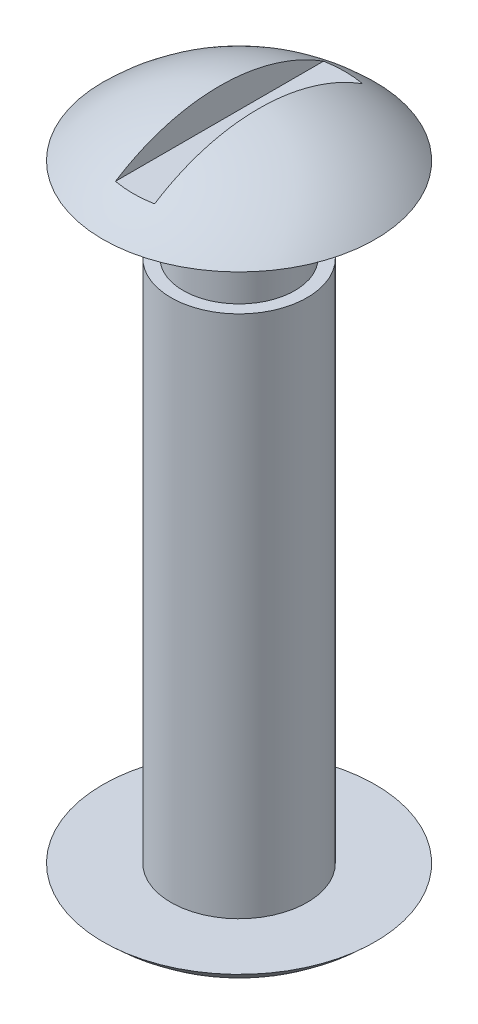
ISO-10303-21;
HEADER;
FILE_DESCRIPTION(('STEP AP214'),'2;1');
FILE_NAME('part.step','',(''),(''),'','','');
FILE_SCHEMA(('AUTOMOTIVE_DESIGN { 1 0 10303 214 1 1 1 1 }'));
ENDSEC;
DATA;
#1=APPLICATION_CONTEXT('core data for automotive mechanical design processes');
#2=APPLICATION_PROTOCOL_DEFINITION('international standard','automotive_design',2000,#1);
#3=PRODUCT_CONTEXT('',#1,'mechanical');
#4=PRODUCT('Part','Part','',(#3));
#5=PRODUCT_RELATED_PRODUCT_CATEGORY('part','',(#4));
#6=PRODUCT_DEFINITION_FORMATION('','',#4);
#7=PRODUCT_DEFINITION_CONTEXT('part definition',#1,'design');
#8=PRODUCT_DEFINITION('design','',#6,#7);
#9=PRODUCT_DEFINITION_SHAPE('','',#8);
#10=(LENGTH_UNIT() NAMED_UNIT(*) SI_UNIT(.MILLI.,.METRE.));
#11=(NAMED_UNIT(*) PLANE_ANGLE_UNIT() SI_UNIT($,.RADIAN.));
#12=(NAMED_UNIT(*) SI_UNIT($,.STERADIAN.) SOLID_ANGLE_UNIT());
#13=UNCERTAINTY_MEASURE_WITH_UNIT(LENGTH_MEASURE(1.E-05),#10,'distance_accuracy_value','');
#14=(GEOMETRIC_REPRESENTATION_CONTEXT(3) GLOBAL_UNCERTAINTY_ASSIGNED_CONTEXT((#13)) GLOBAL_UNIT_ASSIGNED_CONTEXT((#10,
#11,#12)) REPRESENTATION_CONTEXT('',''));
#15=CARTESIAN_POINT('',(0.,0.,0.));
#16=DIRECTION('',(0.,0.,1.));
#17=DIRECTION('',(1.,0.,0.));
#18=AXIS2_PLACEMENT_3D('',#15,#16,#17);
#19=CARTESIAN_POINT('',(2.4765,19.05,0.));
#20=DIRECTION('',(0.,-1.,0.));
#21=DIRECTION('',(1.,0.,0.));
#22=AXIS2_PLACEMENT_3D('',#19,#20,#21);
#23=PLANE('',#22);
#24=CARTESIAN_POINT('',(0.,19.05,0.));
#25=DIRECTION('',(0.,1.,0.));
#26=DIRECTION('',(-1.,0.,0.));
#27=AXIS2_PLACEMENT_3D('',#24,#25,#26);
#28=CIRCLE('',#27,2.032);
#29=CARTESIAN_POINT('',(-2.032,19.05,0.));
#30=VERTEX_POINT('',#29);
#31=EDGE_CURVE('E68',#30,#30,#28,.T.);
#32=ORIENTED_EDGE('',*,*,#31,.F.);
#33=EDGE_LOOP('',(#32));
#34=FACE_BOUND('',#33,.T.);
#35=CARTESIAN_POINT('',(0.,19.05,0.));
#36=DIRECTION('',(0.,1.,0.));
#37=DIRECTION('',(-1.,0.,0.));
#38=AXIS2_PLACEMENT_3D('',#35,#36,#37);
#39=CIRCLE('',#38,2.4765);
#40=CARTESIAN_POINT('',(-2.4765,19.05,0.));
#41=VERTEX_POINT('',#40);
#42=EDGE_CURVE('E72',#41,#41,#39,.T.);
#43=ORIENTED_EDGE('',*,*,#42,.T.);
#44=EDGE_LOOP('',(#43));
#45=FACE_BOUND('',#44,.T.);
#46=ADVANCED_FACE('F33',(#34,#45),#23,.F.);
#47=CARTESIAN_POINT('',(0.,24.1554,0.));
#48=DIRECTION('',(0.,1.,0.));
#49=DIRECTION('',(-1.,0.,0.));
#50=AXIS2_PLACEMENT_3D('',#47,#48,#49);
#51=CYLINDRICAL_SURFACE('',#50,2.4765);
#52=ORIENTED_EDGE('',*,*,#42,.F.);
#53=EDGE_LOOP('',(#52));
#54=FACE_BOUND('',#53,.T.);
#55=CARTESIAN_POINT('',(0.,0.,0.));
#56=DIRECTION('',(0.,1.,0.));
#57=DIRECTION('',(-1.,0.,0.));
#58=AXIS2_PLACEMENT_3D('',#55,#56,#57);
#59=CIRCLE('',#58,2.4765);
#60=CARTESIAN_POINT('',(-2.4765,0.,0.));
#61=VERTEX_POINT('',#60);
#62=EDGE_CURVE('E76',#61,#61,#59,.T.);
#63=ORIENTED_EDGE('',*,*,#62,.T.);
#64=EDGE_LOOP('',(#63));
#65=FACE_BOUND('',#64,.T.);
#66=ADVANCED_FACE('F96',(#54,#65),#51,.T.);
#67=CARTESIAN_POINT('',(2.4765,0.,0.));
#68=DIRECTION('',(0.,-1.,0.));
#69=DIRECTION('',(1.,0.,0.));
#70=AXIS2_PLACEMENT_3D('',#67,#68,#69);
#71=PLANE('',#70);
#72=ORIENTED_EDGE('',*,*,#62,.F.);
#73=EDGE_LOOP('',(#72));
#74=FACE_BOUND('',#73,.T.);
#75=CARTESIAN_POINT('',(0.,0.,0.));
#76=DIRECTION('',(0.,1.,0.));
#77=DIRECTION('',(-1.,0.,0.));
#78=AXIS2_PLACEMENT_3D('',#75,#76,#77);
#79=CIRCLE('',#78,4.95300000000001);
#80=CARTESIAN_POINT('',(-4.95300000000001,0.,0.));
#81=VERTEX_POINT('',#80);
#82=EDGE_CURVE('E79',#81,#81,#79,.T.);
#83=ORIENTED_EDGE('',*,*,#82,.T.);
#84=EDGE_LOOP('',(#83));
#85=FACE_BOUND('',#84,.T.);
#86=ADVANCED_FACE('F101',(#74,#85),#71,.F.);
#87=CARTESIAN_POINT('',(0.,5.02046875000001,0.));
#88=DIRECTION('',(0.,1.,0.));
#89=DIRECTION('',(-1.,0.,0.));
#90=AXIS2_PLACEMENT_3D('',#87,#88,#89);
#91=SPHERICAL_SURFACE('',#90,7.05246875000001);
#92=ORIENTED_EDGE('',*,*,#82,.F.);
#93=EDGE_LOOP('',(#92));
#94=FACE_BOUND('',#93,.T.);
#95=ADVANCED_FACE('F106',(#94),#91,.T.);
#96=CARTESIAN_POINT('',(0.,17.10293125,0.));
#97=DIRECTION('',(0.,1.,0.));
#98=DIRECTION('',(1.,0.,0.));
#99=AXIS2_PLACEMENT_3D('',#96,#97,#98);
#100=SPHERICAL_SURFACE('',#99,7.05246875000002);
#101=CARTESIAN_POINT('',(0.711200000000001,17.10293125,0.));
#102=DIRECTION('',(1.,0.,0.));
#103=DIRECTION('',(0.,1.,0.));
#104=AXIS2_PLACEMENT_3D('',#101,#102,#103);
#105=CIRCLE('',#104,7.01651694430554);
#106=CARTESIAN_POINT('',(0.7112,23.0124,-3.78281497333666));
#107=VERTEX_POINT('',#106);
#108=CARTESIAN_POINT('',(0.7112,23.0124,3.78281497333666));
#109=VERTEX_POINT('',#108);
#110=EDGE_CURVE('E66',#107,#109,#105,.T.);
#111=ORIENTED_EDGE('',*,*,#110,.T.);
#112=CARTESIAN_POINT('',(0.,23.0124,0.));
#113=DIRECTION('',(0.,-1.,0.));
#114=DIRECTION('',(0.,0.,-1.));
#115=AXIS2_PLACEMENT_3D('',#112,#113,#114);
#116=CIRCLE('',#115,3.84909009539917);
#117=CARTESIAN_POINT('',(-0.7112,23.0124,3.78281497333666));
#118=VERTEX_POINT('',#117);
#119=EDGE_CURVE('E11',#109,#118,#116,.T.);
#120=ORIENTED_EDGE('',*,*,#119,.T.);
#121=CARTESIAN_POINT('',(-0.711199999999999,17.10293125,0.));
#122=DIRECTION('',(-1.,0.,0.));
#123=DIRECTION('',(0.,-1.,0.));
#124=AXIS2_PLACEMENT_3D('',#121,#122,#123);
#125=CIRCLE('',#124,7.01651694430554);
#126=CARTESIAN_POINT('',(-0.7112,23.0124,-3.78281497333666));
#127=VERTEX_POINT('',#126);
#128=EDGE_CURVE('E36',#118,#127,#125,.T.);
#129=ORIENTED_EDGE('',*,*,#128,.T.);
#130=EDGE_CURVE('E42',#127,#107,#116,.T.);
#131=ORIENTED_EDGE('',*,*,#130,.T.);
#132=EDGE_LOOP('',(#111,#120,#129,#131));
#133=FACE_BOUND('',#132,.T.);
#134=CARTESIAN_POINT('',(0.,22.1234,0.));
#135=DIRECTION('',(0.,1.,0.));
#136=DIRECTION('',(-1.,0.,0.));
#137=AXIS2_PLACEMENT_3D('',#134,#135,#136);
#138=CIRCLE('',#137,4.95300000000001);
#139=CARTESIAN_POINT('',(-4.95300000000001,22.1234,0.));
#140=VERTEX_POINT('',#139);
#141=EDGE_CURVE('E82',#140,#140,#138,.T.);
#142=ORIENTED_EDGE('',*,*,#141,.T.);
#143=EDGE_LOOP('',(#142));
#144=FACE_BOUND('',#143,.T.);
#145=ADVANCED_FACE('F70',(#133,#144),#100,.T.);
#146=CARTESIAN_POINT('',(4.95300000000001,22.1234,0.));
#147=DIRECTION('',(0.,1.,0.));
#148=DIRECTION('',(-1.,0.,0.));
#149=AXIS2_PLACEMENT_3D('',#146,#147,#148);
#150=PLANE('',#149);
#151=ORIENTED_EDGE('',*,*,#141,.F.);
#152=EDGE_LOOP('',(#151));
#153=FACE_BOUND('',#152,.T.);
#154=CARTESIAN_POINT('',(0.,22.1234,0.));
#155=DIRECTION('',(0.,1.,0.));
#156=DIRECTION('',(-1.,0.,0.));
#157=AXIS2_PLACEMENT_3D('',#154,#155,#156);
#158=CIRCLE('',#157,2.032);
#159=CARTESIAN_POINT('',(-2.032,22.1234,0.));
#160=VERTEX_POINT('',#159);
#161=EDGE_CURVE('E85',#160,#160,#158,.T.);
#162=ORIENTED_EDGE('',*,*,#161,.T.);
#163=EDGE_LOOP('',(#162));
#164=FACE_BOUND('',#163,.T.);
#165=ADVANCED_FACE('F115',(#153,#164),#150,.F.);
#166=CARTESIAN_POINT('',(0.,24.1554,0.));
#167=DIRECTION('',(0.,1.,0.));
#168=DIRECTION('',(-1.,0.,0.));
#169=AXIS2_PLACEMENT_3D('',#166,#167,#168);
#170=CYLINDRICAL_SURFACE('',#169,2.032);
#171=ORIENTED_EDGE('',*,*,#161,.F.);
#172=EDGE_LOOP('',(#171));
#173=FACE_BOUND('',#172,.T.);
#174=ORIENTED_EDGE('',*,*,#31,.T.);
#175=EDGE_LOOP('',(#174));
#176=FACE_BOUND('',#175,.T.);
#177=ADVANCED_FACE('F92',(#173,#176),#170,.T.);
#178=CARTESIAN_POINT('',(-0.7112,24.2824,-4.95300000000001));
#179=DIRECTION('',(-1.,0.,0.));
#180=DIRECTION('',(0.,-1.,0.));
#181=AXIS2_PLACEMENT_3D('',#178,#179,#180);
#182=PLANE('',#181);
#183=DIRECTION('',(0.,0.,1.));
#184=VECTOR('',#183,1.);
#185=CARTESIAN_POINT('',(-0.7112,23.0124,-4.95300000000001));
#186=LINE('',#185,#184);
#187=EDGE_CURVE('E61',#127,#118,#186,.T.);
#188=ORIENTED_EDGE('',*,*,#187,.F.);
#189=ORIENTED_EDGE('',*,*,#128,.F.);
#190=EDGE_LOOP('',(#188,#189));
#191=FACE_BOUND('',#190,.T.);
#192=ADVANCED_FACE('F123',(#191),#182,.F.);
#193=CARTESIAN_POINT('',(0.7112,24.2824,-4.95300000000001));
#194=DIRECTION('',(1.,0.,0.));
#195=DIRECTION('',(0.,1.,0.));
#196=AXIS2_PLACEMENT_3D('',#193,#194,#195);
#197=PLANE('',#196);
#198=DIRECTION('',(0.,0.,1.));
#199=VECTOR('',#198,1.);
#200=CARTESIAN_POINT('',(0.7112,23.0124,-4.95300000000001));
#201=LINE('',#200,#199);
#202=EDGE_CURVE('E49',#107,#109,#201,.T.);
#203=ORIENTED_EDGE('',*,*,#202,.T.);
#204=ORIENTED_EDGE('',*,*,#110,.F.);
#205=EDGE_LOOP('',(#203,#204));
#206=FACE_BOUND('',#205,.T.);
#207=ADVANCED_FACE('F65',(#206),#197,.F.);
#208=CARTESIAN_POINT('',(-0.7112,23.0124,-4.95300000000001));
#209=DIRECTION('',(0.,-1.,0.));
#210=DIRECTION('',(0.,0.,-1.));
#211=AXIS2_PLACEMENT_3D('',#208,#209,#210);
#212=PLANE('',#211);
#213=ORIENTED_EDGE('',*,*,#202,.F.);
#214=ORIENTED_EDGE('',*,*,#130,.F.);
#215=ORIENTED_EDGE('',*,*,#187,.T.);
#216=ORIENTED_EDGE('',*,*,#119,.F.);
#217=EDGE_LOOP('',(#213,#214,#215,#216));
#218=FACE_BOUND('',#217,.T.);
#219=ADVANCED_FACE('F60',(#218),#212,.F.);
#220=CLOSED_SHELL('',(#46,#66,#86,#95,#145,#165,#177,#192,#207,#219));
#221=MANIFOLD_SOLID_BREP('B2',#220);
#222=ADVANCED_BREP_SHAPE_REPRESENTATION('',(#18,#221),#14);
#223=SHAPE_DEFINITION_REPRESENTATION(#9,#222);
ENDSEC;
END-ISO-10303-21;
